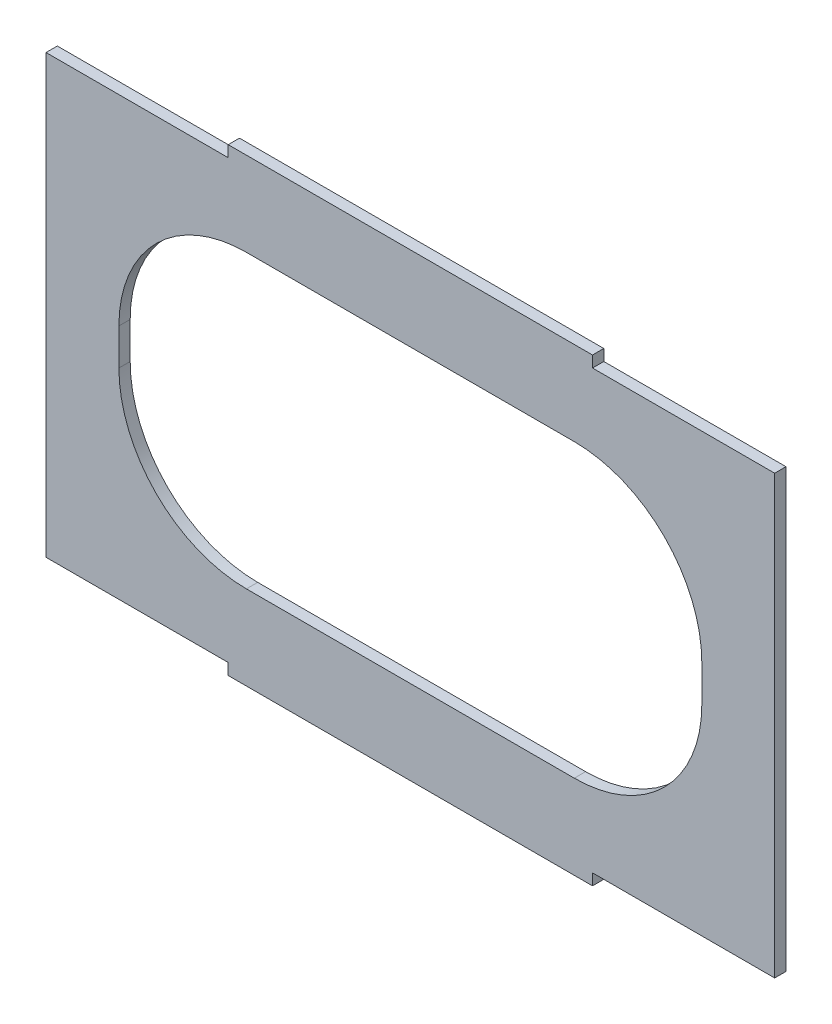
ISO-10303-21;
HEADER;
FILE_DESCRIPTION(('STEP AP214'),'2;1');
FILE_NAME('part.step','',(''),(''),'','','');
FILE_SCHEMA(('AUTOMOTIVE_DESIGN { 1 0 10303 214 1 1 1 1 }'));
ENDSEC;
DATA;
#1=APPLICATION_CONTEXT('core data for automotive mechanical design processes');
#2=APPLICATION_PROTOCOL_DEFINITION('international standard','automotive_design',2000,#1);
#3=PRODUCT_CONTEXT('',#1,'mechanical');
#4=PRODUCT('Part','Part','',(#3));
#5=PRODUCT_RELATED_PRODUCT_CATEGORY('part','',(#4));
#6=PRODUCT_DEFINITION_FORMATION('','',#4);
#7=PRODUCT_DEFINITION_CONTEXT('part definition',#1,'design');
#8=PRODUCT_DEFINITION('design','',#6,#7);
#9=PRODUCT_DEFINITION_SHAPE('','',#8);
#10=(LENGTH_UNIT() NAMED_UNIT(*) SI_UNIT(.MILLI.,.METRE.));
#11=(NAMED_UNIT(*) PLANE_ANGLE_UNIT() SI_UNIT($,.RADIAN.));
#12=(NAMED_UNIT(*) SI_UNIT($,.STERADIAN.) SOLID_ANGLE_UNIT());
#13=UNCERTAINTY_MEASURE_WITH_UNIT(LENGTH_MEASURE(1.E-05),#10,'distance_accuracy_value','');
#14=(GEOMETRIC_REPRESENTATION_CONTEXT(3) GLOBAL_UNCERTAINTY_ASSIGNED_CONTEXT((#13)) GLOBAL_UNIT_ASSIGNED_CONTEXT((#10,
#11,#12)) REPRESENTATION_CONTEXT('',''));
#15=CARTESIAN_POINT('',(0.,0.,0.));
#16=DIRECTION('',(0.,0.,1.));
#17=DIRECTION('',(1.,0.,0.));
#18=AXIS2_PLACEMENT_3D('',#15,#16,#17);
#19=CARTESIAN_POINT('',(-100.,-60.,3.1));
#20=DIRECTION('',(0.,1.,0.));
#21=DIRECTION('',(0.,0.,1.));
#22=AXIS2_PLACEMENT_3D('',#19,#20,#21);
#23=PLANE('',#22);
#24=DIRECTION('',(0.,0.,1.));
#25=VECTOR('',#24,1.);
#26=CARTESIAN_POINT('',(50.,-60.,0.));
#27=LINE('',#26,#25);
#28=CARTESIAN_POINT('',(50.,-60.,0.));
#29=VERTEX_POINT('',#28);
#30=CARTESIAN_POINT('',(50.,-60.,3.1));
#31=VERTEX_POINT('',#30);
#32=EDGE_CURVE('E206',#29,#31,#27,.T.);
#33=ORIENTED_EDGE('',*,*,#32,.F.);
#34=DIRECTION('',(1.,0.,0.));
#35=VECTOR('',#34,1.);
#36=CARTESIAN_POINT('',(-100.,-60.,0.));
#37=LINE('',#36,#35);
#38=CARTESIAN_POINT('',(100.,-60.,0.));
#39=VERTEX_POINT('',#38);
#40=EDGE_CURVE('E256',#29,#39,#37,.T.);
#41=ORIENTED_EDGE('',*,*,#40,.T.);
#42=DIRECTION('',(0.,0.,-1.));
#43=VECTOR('',#42,1.);
#44=CARTESIAN_POINT('',(100.,-60.,3.1));
#45=LINE('',#44,#43);
#46=CARTESIAN_POINT('',(100.,-60.,3.1));
#47=VERTEX_POINT('',#46);
#48=EDGE_CURVE('E263',#47,#39,#45,.T.);
#49=ORIENTED_EDGE('',*,*,#48,.F.);
#50=DIRECTION('',(1.,0.,0.));
#51=VECTOR('',#50,1.);
#52=CARTESIAN_POINT('',(-100.,-60.,3.1));
#53=LINE('',#52,#51);
#54=EDGE_CURVE('E296',#31,#47,#53,.T.);
#55=ORIENTED_EDGE('',*,*,#54,.F.);
#56=EDGE_LOOP('',(#33,#41,#49,#55));
#57=FACE_BOUND('',#56,.T.);
#58=ADVANCED_FACE('F32',(#57),#23,.F.);
#59=CARTESIAN_POINT('',(-100.,60.,3.1));
#60=DIRECTION('',(0.,-1.,0.));
#61=DIRECTION('',(0.,0.,-1.));
#62=AXIS2_PLACEMENT_3D('',#59,#60,#61);
#63=PLANE('',#62);
#64=DIRECTION('',(0.,0.,1.));
#65=VECTOR('',#64,1.);
#66=CARTESIAN_POINT('',(-50.,60.,0.));
#67=LINE('',#66,#65);
#68=CARTESIAN_POINT('',(-50.,60.,0.));
#69=VERTEX_POINT('',#68);
#70=CARTESIAN_POINT('',(-50.,60.,3.1));
#71=VERTEX_POINT('',#70);
#72=EDGE_CURVE('E235',#69,#71,#67,.T.);
#73=ORIENTED_EDGE('',*,*,#72,.F.);
#74=DIRECTION('',(-1.,0.,0.));
#75=VECTOR('',#74,1.);
#76=CARTESIAN_POINT('',(-100.,60.,0.));
#77=LINE('',#76,#75);
#78=CARTESIAN_POINT('',(-100.,60.,0.));
#79=VERTEX_POINT('',#78);
#80=EDGE_CURVE('E281',#69,#79,#77,.T.);
#81=ORIENTED_EDGE('',*,*,#80,.T.);
#82=DIRECTION('',(0.,0.,-1.));
#83=VECTOR('',#82,1.);
#84=CARTESIAN_POINT('',(-100.,60.,3.1));
#85=LINE('',#84,#83);
#86=CARTESIAN_POINT('',(-100.,60.,3.1));
#87=VERTEX_POINT('',#86);
#88=EDGE_CURVE('E271',#87,#79,#85,.T.);
#89=ORIENTED_EDGE('',*,*,#88,.F.);
#90=DIRECTION('',(-1.,0.,0.));
#91=VECTOR('',#90,1.);
#92=CARTESIAN_POINT('',(-100.,60.,3.1));
#93=LINE('',#92,#91);
#94=EDGE_CURVE('E308',#71,#87,#93,.T.);
#95=ORIENTED_EDGE('',*,*,#94,.F.);
#96=EDGE_LOOP('',(#73,#81,#89,#95));
#97=FACE_BOUND('',#96,.T.);
#98=ADVANCED_FACE('F364',(#97),#63,.F.);
#99=CARTESIAN_POINT('',(0.,0.,3.1));
#100=DIRECTION('',(0.,0.,-1.));
#101=DIRECTION('',(-1.,0.,0.));
#102=AXIS2_PLACEMENT_3D('',#99,#100,#101);
#103=PLANE('',#102);
#104=DIRECTION('',(0.,1.,0.));
#105=VECTOR('',#104,1.);
#106=CARTESIAN_POINT('',(100.,-60.,3.1));
#107=LINE('',#106,#105);
#108=CARTESIAN_POINT('',(100.,60.,3.1));
#109=VERTEX_POINT('',#108);
#110=EDGE_CURVE('E255',#47,#109,#107,.T.);
#111=ORIENTED_EDGE('',*,*,#110,.T.);
#112=CARTESIAN_POINT('',(50.,60.,3.1));
#113=VERTEX_POINT('',#112);
#114=EDGE_CURVE('E304',#109,#113,#93,.T.);
#115=ORIENTED_EDGE('',*,*,#114,.T.);
#116=DIRECTION('',(0.,1.,0.));
#117=VECTOR('',#116,1.);
#118=CARTESIAN_POINT('',(50.,63.1,3.1));
#119=LINE('',#118,#117);
#120=CARTESIAN_POINT('',(50.,63.1,3.1));
#121=VERTEX_POINT('',#120);
#122=EDGE_CURVE('E224',#113,#121,#119,.T.);
#123=ORIENTED_EDGE('',*,*,#122,.T.);
#124=DIRECTION('',(-1.,0.,0.));
#125=VECTOR('',#124,1.);
#126=CARTESIAN_POINT('',(-50.,63.1,3.1));
#127=LINE('',#126,#125);
#128=CARTESIAN_POINT('',(-50.,63.1,3.1));
#129=VERTEX_POINT('',#128);
#130=EDGE_CURVE('E220',#121,#129,#127,.T.);
#131=ORIENTED_EDGE('',*,*,#130,.T.);
#132=DIRECTION('',(0.,-1.,0.));
#133=VECTOR('',#132,1.);
#134=CARTESIAN_POINT('',(-50.,63.1,3.1));
#135=LINE('',#134,#133);
#136=EDGE_CURVE('E223',#129,#71,#135,.T.);
#137=ORIENTED_EDGE('',*,*,#136,.T.);
#138=ORIENTED_EDGE('',*,*,#94,.T.);
#139=DIRECTION('',(0.,-1.,0.));
#140=VECTOR('',#139,1.);
#141=CARTESIAN_POINT('',(-100.,-60.,3.1));
#142=LINE('',#141,#140);
#143=CARTESIAN_POINT('',(-100.,-60.,3.1));
#144=VERTEX_POINT('',#143);
#145=EDGE_CURVE('E292',#87,#144,#142,.T.);
#146=ORIENTED_EDGE('',*,*,#145,.T.);
#147=CARTESIAN_POINT('',(-50.,-60.,3.1));
#148=VERTEX_POINT('',#147);
#149=EDGE_CURVE('E268',#144,#148,#53,.T.);
#150=ORIENTED_EDGE('',*,*,#149,.T.);
#151=DIRECTION('',(0.,-1.,0.));
#152=VECTOR('',#151,1.);
#153=CARTESIAN_POINT('',(-50.,-63.1,3.1));
#154=LINE('',#153,#152);
#155=CARTESIAN_POINT('',(-50.,-63.1,3.1));
#156=VERTEX_POINT('',#155);
#157=EDGE_CURVE('E416',#148,#156,#154,.T.);
#158=ORIENTED_EDGE('',*,*,#157,.T.);
#159=DIRECTION('',(1.,0.,0.));
#160=VECTOR('',#159,1.);
#161=CARTESIAN_POINT('',(-50.,-63.1,3.1));
#162=LINE('',#161,#160);
#163=CARTESIAN_POINT('',(50.,-63.1,3.1));
#164=VERTEX_POINT('',#163);
#165=EDGE_CURVE('E175',#156,#164,#162,.T.);
#166=ORIENTED_EDGE('',*,*,#165,.T.);
#167=DIRECTION('',(0.,1.,0.));
#168=VECTOR('',#167,1.);
#169=CARTESIAN_POINT('',(50.,-63.1,3.1));
#170=LINE('',#169,#168);
#171=EDGE_CURVE('E196',#164,#31,#170,.T.);
#172=ORIENTED_EDGE('',*,*,#171,.T.);
#173=ORIENTED_EDGE('',*,*,#54,.T.);
#174=EDGE_LOOP('',(#111,#115,#123,#131,#137,#138,#146,#150,#158,#166,#172,#173));
#175=FACE_BOUND('',#174,.T.);
#176=DIRECTION('',(0.,1.,0.));
#177=VECTOR('',#176,1.);
#178=CARTESIAN_POINT('',(80.,-40.,3.1));
#179=LINE('',#178,#177);
#180=CARTESIAN_POINT('',(80.,-5.00000000000001,3.1));
#181=VERTEX_POINT('',#180);
#182=CARTESIAN_POINT('',(80.,5.00000000000002,3.1));
#183=VERTEX_POINT('',#182);
#184=EDGE_CURVE('E318',#181,#183,#179,.T.);
#185=ORIENTED_EDGE('',*,*,#184,.F.);
#186=CARTESIAN_POINT('',(45.,-5.,3.1));
#187=DIRECTION('',(0.,0.,-1.));
#188=DIRECTION('',(-1.,0.,0.));
#189=AXIS2_PLACEMENT_3D('',#186,#187,#188);
#190=CIRCLE('',#189,35.);
#191=CARTESIAN_POINT('',(45.,-40.,3.1));
#192=VERTEX_POINT('',#191);
#193=EDGE_CURVE('E591',#181,#192,#190,.T.);
#194=ORIENTED_EDGE('',*,*,#193,.T.);
#195=DIRECTION('',(1.,0.,0.));
#196=VECTOR('',#195,1.);
#197=CARTESIAN_POINT('',(-80.,-40.,3.1));
#198=LINE('',#197,#196);
#199=CARTESIAN_POINT('',(-45.,-40.,3.1));
#200=VERTEX_POINT('',#199);
#201=EDGE_CURVE('E289',#200,#192,#198,.T.);
#202=ORIENTED_EDGE('',*,*,#201,.F.);
#203=CARTESIAN_POINT('',(-45.,-5.,3.1));
#204=DIRECTION('',(0.,0.,-1.));
#205=DIRECTION('',(-1.,0.,0.));
#206=AXIS2_PLACEMENT_3D('',#203,#204,#205);
#207=CIRCLE('',#206,35.);
#208=CARTESIAN_POINT('',(-80.,-5.00000000000001,3.1));
#209=VERTEX_POINT('',#208);
#210=EDGE_CURVE('E47',#200,#209,#207,.T.);
#211=ORIENTED_EDGE('',*,*,#210,.T.);
#212=DIRECTION('',(0.,-1.,0.));
#213=VECTOR('',#212,1.);
#214=CARTESIAN_POINT('',(-80.,-40.,3.1));
#215=LINE('',#214,#213);
#216=CARTESIAN_POINT('',(-80.,5.00000000000002,3.1));
#217=VERTEX_POINT('',#216);
#218=EDGE_CURVE('E329',#217,#209,#215,.T.);
#219=ORIENTED_EDGE('',*,*,#218,.F.);
#220=CARTESIAN_POINT('',(-45.,5.00000000000004,3.1));
#221=DIRECTION('',(0.,0.,-1.));
#222=DIRECTION('',(-1.,0.,0.));
#223=AXIS2_PLACEMENT_3D('',#220,#221,#222);
#224=CIRCLE('',#223,35.);
#225=CARTESIAN_POINT('',(-45.,40.,3.1));
#226=VERTEX_POINT('',#225);
#227=EDGE_CURVE('E11',#217,#226,#224,.T.);
#228=ORIENTED_EDGE('',*,*,#227,.T.);
#229=DIRECTION('',(-1.,0.,0.));
#230=VECTOR('',#229,1.);
#231=CARTESIAN_POINT('',(-80.,40.,3.1));
#232=LINE('',#231,#230);
#233=CARTESIAN_POINT('',(45.,40.,3.1));
#234=VERTEX_POINT('',#233);
#235=EDGE_CURVE('E331',#234,#226,#232,.T.);
#236=ORIENTED_EDGE('',*,*,#235,.F.);
#237=CARTESIAN_POINT('',(45.,5.00000000000004,3.1));
#238=DIRECTION('',(0.,0.,-1.));
#239=DIRECTION('',(-1.,0.,0.));
#240=AXIS2_PLACEMENT_3D('',#237,#238,#239);
#241=CIRCLE('',#240,35.);
#242=EDGE_CURVE('E595',#234,#183,#241,.T.);
#243=ORIENTED_EDGE('',*,*,#242,.T.);
#244=EDGE_LOOP('',(#185,#194,#202,#211,#219,#228,#236,#243));
#245=FACE_BOUND('',#244,.T.);
#246=ADVANCED_FACE('F346',(#175,#245),#103,.F.);
#247=CARTESIAN_POINT('',(0.,0.,0.));
#248=DIRECTION('',(0.,0.,-1.));
#249=DIRECTION('',(-1.,0.,0.));
#250=AXIS2_PLACEMENT_3D('',#247,#248,#249);
#251=PLANE('',#250);
#252=DIRECTION('',(0.,1.,0.));
#253=VECTOR('',#252,1.);
#254=CARTESIAN_POINT('',(100.,-60.,0.));
#255=LINE('',#254,#253);
#256=CARTESIAN_POINT('',(100.,60.,0.));
#257=VERTEX_POINT('',#256);
#258=EDGE_CURVE('E285',#39,#257,#255,.T.);
#259=ORIENTED_EDGE('',*,*,#258,.F.);
#260=ORIENTED_EDGE('',*,*,#40,.F.);
#261=DIRECTION('',(0.,1.,0.));
#262=VECTOR('',#261,1.);
#263=CARTESIAN_POINT('',(50.,-63.1,0.));
#264=LINE('',#263,#262);
#265=CARTESIAN_POINT('',(50.,-63.1,0.));
#266=VERTEX_POINT('',#265);
#267=EDGE_CURVE('E180',#266,#29,#264,.T.);
#268=ORIENTED_EDGE('',*,*,#267,.F.);
#269=DIRECTION('',(1.,0.,0.));
#270=VECTOR('',#269,1.);
#271=CARTESIAN_POINT('',(-50.,-63.1,0.));
#272=LINE('',#271,#270);
#273=CARTESIAN_POINT('',(-50.,-63.1,0.));
#274=VERTEX_POINT('',#273);
#275=EDGE_CURVE('E173',#274,#266,#272,.T.);
#276=ORIENTED_EDGE('',*,*,#275,.F.);
#277=DIRECTION('',(0.,-1.,0.));
#278=VECTOR('',#277,1.);
#279=CARTESIAN_POINT('',(-50.,-63.1,0.));
#280=LINE('',#279,#278);
#281=CARTESIAN_POINT('',(-50.,-60.,0.));
#282=VERTEX_POINT('',#281);
#283=EDGE_CURVE('E189',#282,#274,#280,.T.);
#284=ORIENTED_EDGE('',*,*,#283,.F.);
#285=CARTESIAN_POINT('',(-100.,-60.,0.));
#286=VERTEX_POINT('',#285);
#287=EDGE_CURVE('E252',#286,#282,#37,.T.);
#288=ORIENTED_EDGE('',*,*,#287,.F.);
#289=DIRECTION('',(0.,-1.,0.));
#290=VECTOR('',#289,1.);
#291=CARTESIAN_POINT('',(-100.,-60.,0.));
#292=LINE('',#291,#290);
#293=EDGE_CURVE('E261',#79,#286,#292,.T.);
#294=ORIENTED_EDGE('',*,*,#293,.F.);
#295=ORIENTED_EDGE('',*,*,#80,.F.);
#296=DIRECTION('',(0.,-1.,0.));
#297=VECTOR('',#296,1.);
#298=CARTESIAN_POINT('',(-50.,63.1,0.));
#299=LINE('',#298,#297);
#300=CARTESIAN_POINT('',(-50.,63.1,0.));
#301=VERTEX_POINT('',#300);
#302=EDGE_CURVE('E218',#301,#69,#299,.T.);
#303=ORIENTED_EDGE('',*,*,#302,.F.);
#304=DIRECTION('',(-1.,0.,0.));
#305=VECTOR('',#304,1.);
#306=CARTESIAN_POINT('',(-50.,63.1,0.));
#307=LINE('',#306,#305);
#308=CARTESIAN_POINT('',(50.,63.1,0.));
#309=VERTEX_POINT('',#308);
#310=EDGE_CURVE('E215',#309,#301,#307,.T.);
#311=ORIENTED_EDGE('',*,*,#310,.F.);
#312=DIRECTION('',(0.,1.,0.));
#313=VECTOR('',#312,1.);
#314=CARTESIAN_POINT('',(50.,63.1,0.));
#315=LINE('',#314,#313);
#316=CARTESIAN_POINT('',(50.,60.,0.));
#317=VERTEX_POINT('',#316);
#318=EDGE_CURVE('E219',#317,#309,#315,.T.);
#319=ORIENTED_EDGE('',*,*,#318,.F.);
#320=EDGE_CURVE('E278',#257,#317,#77,.T.);
#321=ORIENTED_EDGE('',*,*,#320,.F.);
#322=EDGE_LOOP('',(#259,#260,#268,#276,#284,#288,#294,#295,#303,#311,#319,#321));
#323=FACE_BOUND('',#322,.T.);
#324=DIRECTION('',(0.,-1.,0.));
#325=VECTOR('',#324,1.);
#326=CARTESIAN_POINT('',(-80.,-40.,0.));
#327=LINE('',#326,#325);
#328=CARTESIAN_POINT('',(-80.,5.00000000000002,0.));
#329=VERTEX_POINT('',#328);
#330=CARTESIAN_POINT('',(-80.,-5.00000000000001,0.));
#331=VERTEX_POINT('',#330);
#332=EDGE_CURVE('E319',#329,#331,#327,.T.);
#333=ORIENTED_EDGE('',*,*,#332,.T.);
#334=CARTESIAN_POINT('',(-45.,-5.,0.));
#335=DIRECTION('',(0.,0.,-1.));
#336=DIRECTION('',(-1.,0.,0.));
#337=AXIS2_PLACEMENT_3D('',#334,#335,#336);
#338=CIRCLE('',#337,35.);
#339=CARTESIAN_POINT('',(-45.,-40.,0.));
#340=VERTEX_POINT('',#339);
#341=EDGE_CURVE('E597',#331,#340,#338,.F.);
#342=ORIENTED_EDGE('',*,*,#341,.T.);
#343=DIRECTION('',(1.,0.,0.));
#344=VECTOR('',#343,1.);
#345=CARTESIAN_POINT('',(-80.,-40.,0.));
#346=LINE('',#345,#344);
#347=CARTESIAN_POINT('',(45.,-40.,0.));
#348=VERTEX_POINT('',#347);
#349=EDGE_CURVE('E315',#340,#348,#346,.T.);
#350=ORIENTED_EDGE('',*,*,#349,.T.);
#351=CARTESIAN_POINT('',(45.,-5.,0.));
#352=DIRECTION('',(0.,0.,-1.));
#353=DIRECTION('',(-1.,0.,0.));
#354=AXIS2_PLACEMENT_3D('',#351,#352,#353);
#355=CIRCLE('',#354,35.);
#356=CARTESIAN_POINT('',(80.,-5.00000000000001,0.));
#357=VERTEX_POINT('',#356);
#358=EDGE_CURVE('E589',#348,#357,#355,.F.);
#359=ORIENTED_EDGE('',*,*,#358,.T.);
#360=DIRECTION('',(0.,1.,0.));
#361=VECTOR('',#360,1.);
#362=CARTESIAN_POINT('',(80.,-40.,0.));
#363=LINE('',#362,#361);
#364=CARTESIAN_POINT('',(80.,5.00000000000002,0.));
#365=VERTEX_POINT('',#364);
#366=EDGE_CURVE('E234',#357,#365,#363,.T.);
#367=ORIENTED_EDGE('',*,*,#366,.T.);
#368=CARTESIAN_POINT('',(45.,5.00000000000004,0.));
#369=DIRECTION('',(0.,0.,-1.));
#370=DIRECTION('',(-1.,0.,0.));
#371=AXIS2_PLACEMENT_3D('',#368,#369,#370);
#372=CIRCLE('',#371,35.);
#373=CARTESIAN_POINT('',(45.,40.,0.));
#374=VERTEX_POINT('',#373);
#375=EDGE_CURVE('E593',#365,#374,#372,.F.);
#376=ORIENTED_EDGE('',*,*,#375,.T.);
#377=DIRECTION('',(-1.,0.,0.));
#378=VECTOR('',#377,1.);
#379=CARTESIAN_POINT('',(-80.,40.,0.));
#380=LINE('',#379,#378);
#381=CARTESIAN_POINT('',(-45.,40.,0.));
#382=VERTEX_POINT('',#381);
#383=EDGE_CURVE('E322',#374,#382,#380,.T.);
#384=ORIENTED_EDGE('',*,*,#383,.T.);
#385=CARTESIAN_POINT('',(-45.,5.00000000000004,0.));
#386=DIRECTION('',(0.,0.,-1.));
#387=DIRECTION('',(-1.,0.,0.));
#388=AXIS2_PLACEMENT_3D('',#385,#386,#387);
#389=CIRCLE('',#388,35.);
#390=EDGE_CURVE('E40',#382,#329,#389,.F.);
#391=ORIENTED_EDGE('',*,*,#390,.T.);
#392=EDGE_LOOP('',(#333,#342,#350,#359,#367,#376,#384,#391));
#393=FACE_BOUND('',#392,.T.);
#394=ADVANCED_FACE('F186',(#323,#393),#251,.T.);
#395=CARTESIAN_POINT('',(100.,-60.,3.1));
#396=DIRECTION('',(-1.,0.,0.));
#397=DIRECTION('',(0.,0.,1.));
#398=AXIS2_PLACEMENT_3D('',#395,#396,#397);
#399=PLANE('',#398);
#400=ORIENTED_EDGE('',*,*,#258,.T.);
#401=DIRECTION('',(0.,0.,-1.));
#402=VECTOR('',#401,1.);
#403=CARTESIAN_POINT('',(100.,60.,3.1));
#404=LINE('',#403,#402);
#405=EDGE_CURVE('E274',#109,#257,#404,.T.);
#406=ORIENTED_EDGE('',*,*,#405,.F.);
#407=ORIENTED_EDGE('',*,*,#110,.F.);
#408=ORIENTED_EDGE('',*,*,#48,.T.);
#409=EDGE_LOOP('',(#400,#406,#407,#408));
#410=FACE_BOUND('',#409,.T.);
#411=ADVANCED_FACE('F357',(#410),#399,.F.);
#412=ORIENTED_EDGE('',*,*,#320,.T.);
#413=DIRECTION('',(0.,0.,1.));
#414=VECTOR('',#413,1.);
#415=CARTESIAN_POINT('',(50.,60.,0.));
#416=LINE('',#415,#414);
#417=EDGE_CURVE('E230',#317,#113,#416,.T.);
#418=ORIENTED_EDGE('',*,*,#417,.T.);
#419=ORIENTED_EDGE('',*,*,#114,.F.);
#420=ORIENTED_EDGE('',*,*,#405,.T.);
#421=EDGE_LOOP('',(#412,#418,#419,#420));
#422=FACE_BOUND('',#421,.T.);
#423=ADVANCED_FACE('F361',(#422),#63,.F.);
#424=CARTESIAN_POINT('',(-100.,-60.,3.1));
#425=DIRECTION('',(1.,0.,0.));
#426=DIRECTION('',(0.,0.,-1.));
#427=AXIS2_PLACEMENT_3D('',#424,#425,#426);
#428=PLANE('',#427);
#429=ORIENTED_EDGE('',*,*,#293,.T.);
#430=DIRECTION('',(0.,0.,-1.));
#431=VECTOR('',#430,1.);
#432=CARTESIAN_POINT('',(-100.,-60.,3.1));
#433=LINE('',#432,#431);
#434=EDGE_CURVE('E267',#144,#286,#433,.T.);
#435=ORIENTED_EDGE('',*,*,#434,.F.);
#436=ORIENTED_EDGE('',*,*,#145,.F.);
#437=ORIENTED_EDGE('',*,*,#88,.T.);
#438=EDGE_LOOP('',(#429,#435,#436,#437));
#439=FACE_BOUND('',#438,.T.);
#440=ADVANCED_FACE('F366',(#439),#428,.F.);
#441=ORIENTED_EDGE('',*,*,#287,.T.);
#442=DIRECTION('',(0.,0.,1.));
#443=VECTOR('',#442,1.);
#444=CARTESIAN_POINT('',(-50.,-60.,0.));
#445=LINE('',#444,#443);
#446=EDGE_CURVE('E195',#282,#148,#445,.T.);
#447=ORIENTED_EDGE('',*,*,#446,.T.);
#448=ORIENTED_EDGE('',*,*,#149,.F.);
#449=ORIENTED_EDGE('',*,*,#434,.T.);
#450=EDGE_LOOP('',(#441,#447,#448,#449));
#451=FACE_BOUND('',#450,.T.);
#452=ADVANCED_FACE('F349',(#451),#23,.F.);
#453=CARTESIAN_POINT('',(80.,-40.,3.1));
#454=DIRECTION('',(-1.,0.,0.));
#455=DIRECTION('',(0.,0.,1.));
#456=AXIS2_PLACEMENT_3D('',#453,#454,#455);
#457=PLANE('',#456);
#458=ORIENTED_EDGE('',*,*,#366,.F.);
#459=DIRECTION('',(0.,0.,-1.));
#460=VECTOR('',#459,1.);
#461=CARTESIAN_POINT('',(80.,-5.,3.1));
#462=LINE('',#461,#460);
#463=EDGE_CURVE('E583',#357,#181,#462,.F.);
#464=ORIENTED_EDGE('',*,*,#463,.T.);
#465=ORIENTED_EDGE('',*,*,#184,.T.);
#466=DIRECTION('',(0.,0.,-1.));
#467=VECTOR('',#466,1.);
#468=CARTESIAN_POINT('',(80.,5.00000000000004,0.));
#469=LINE('',#468,#467);
#470=EDGE_CURVE('E606',#183,#365,#469,.T.);
#471=ORIENTED_EDGE('',*,*,#470,.T.);
#472=EDGE_LOOP('',(#458,#464,#465,#471));
#473=FACE_BOUND('',#472,.T.);
#474=ADVANCED_FACE('F373',(#473),#457,.T.);
#475=CARTESIAN_POINT('',(-80.,40.,3.1));
#476=DIRECTION('',(0.,-1.,0.));
#477=DIRECTION('',(0.,0.,-1.));
#478=AXIS2_PLACEMENT_3D('',#475,#476,#477);
#479=PLANE('',#478);
#480=ORIENTED_EDGE('',*,*,#383,.F.);
#481=DIRECTION('',(0.,0.,-1.));
#482=VECTOR('',#481,1.);
#483=CARTESIAN_POINT('',(45.,40.,3.1));
#484=LINE('',#483,#482);
#485=EDGE_CURVE('E579',#374,#234,#484,.F.);
#486=ORIENTED_EDGE('',*,*,#485,.T.);
#487=ORIENTED_EDGE('',*,*,#235,.T.);
#488=DIRECTION('',(0.,0.,-1.));
#489=VECTOR('',#488,1.);
#490=CARTESIAN_POINT('',(-45.,40.,0.));
#491=LINE('',#490,#489);
#492=EDGE_CURVE('E573',#226,#382,#491,.T.);
#493=ORIENTED_EDGE('',*,*,#492,.T.);
#494=EDGE_LOOP('',(#480,#486,#487,#493));
#495=FACE_BOUND('',#494,.T.);
#496=ADVANCED_FACE('F387',(#495),#479,.T.);
#497=CARTESIAN_POINT('',(-80.,-40.,3.1));
#498=DIRECTION('',(1.,0.,0.));
#499=DIRECTION('',(0.,0.,-1.));
#500=AXIS2_PLACEMENT_3D('',#497,#498,#499);
#501=PLANE('',#500);
#502=ORIENTED_EDGE('',*,*,#218,.T.);
#503=DIRECTION('',(0.,0.,-1.));
#504=VECTOR('',#503,1.);
#505=CARTESIAN_POINT('',(-80.,-5.,0.));
#506=LINE('',#505,#504);
#507=EDGE_CURVE('E581',#209,#331,#506,.T.);
#508=ORIENTED_EDGE('',*,*,#507,.T.);
#509=ORIENTED_EDGE('',*,*,#332,.F.);
#510=DIRECTION('',(0.,0.,-1.));
#511=VECTOR('',#510,1.);
#512=CARTESIAN_POINT('',(-80.,5.00000000000004,3.1));
#513=LINE('',#512,#511);
#514=EDGE_CURVE('E54',#329,#217,#513,.F.);
#515=ORIENTED_EDGE('',*,*,#514,.T.);
#516=EDGE_LOOP('',(#502,#508,#509,#515));
#517=FACE_BOUND('',#516,.T.);
#518=ADVANCED_FACE('F391',(#517),#501,.T.);
#519=CARTESIAN_POINT('',(-80.,-40.,3.1));
#520=DIRECTION('',(0.,1.,0.));
#521=DIRECTION('',(0.,0.,1.));
#522=AXIS2_PLACEMENT_3D('',#519,#520,#521);
#523=PLANE('',#522);
#524=ORIENTED_EDGE('',*,*,#201,.T.);
#525=DIRECTION('',(0.,0.,-1.));
#526=VECTOR('',#525,1.);
#527=CARTESIAN_POINT('',(45.,-40.,0.));
#528=LINE('',#527,#526);
#529=EDGE_CURVE('E604',#192,#348,#528,.T.);
#530=ORIENTED_EDGE('',*,*,#529,.T.);
#531=ORIENTED_EDGE('',*,*,#349,.F.);
#532=DIRECTION('',(0.,0.,-1.));
#533=VECTOR('',#532,1.);
#534=CARTESIAN_POINT('',(-45.,-40.,3.1));
#535=LINE('',#534,#533);
#536=EDGE_CURVE('E277',#340,#200,#535,.F.);
#537=ORIENTED_EDGE('',*,*,#536,.T.);
#538=EDGE_LOOP('',(#524,#530,#531,#537));
#539=FACE_BOUND('',#538,.T.);
#540=ADVANCED_FACE('F395',(#539),#523,.T.);
#541=CARTESIAN_POINT('',(50.,63.1,0.));
#542=DIRECTION('',(1.,0.,0.));
#543=DIRECTION('',(0.,0.,-1.));
#544=AXIS2_PLACEMENT_3D('',#541,#542,#543);
#545=PLANE('',#544);
#546=ORIENTED_EDGE('',*,*,#122,.F.);
#547=ORIENTED_EDGE('',*,*,#417,.F.);
#548=ORIENTED_EDGE('',*,*,#318,.T.);
#549=DIRECTION('',(0.,0.,1.));
#550=VECTOR('',#549,1.);
#551=CARTESIAN_POINT('',(50.,63.1,0.));
#552=LINE('',#551,#550);
#553=EDGE_CURVE('E245',#309,#121,#552,.T.);
#554=ORIENTED_EDGE('',*,*,#553,.T.);
#555=EDGE_LOOP('',(#546,#547,#548,#554));
#556=FACE_BOUND('',#555,.T.);
#557=ADVANCED_FACE('F362',(#556),#545,.T.);
#558=CARTESIAN_POINT('',(-50.,63.1,0.));
#559=DIRECTION('',(-1.,0.,0.));
#560=DIRECTION('',(0.,0.,1.));
#561=AXIS2_PLACEMENT_3D('',#558,#559,#560);
#562=PLANE('',#561);
#563=ORIENTED_EDGE('',*,*,#136,.F.);
#564=DIRECTION('',(0.,0.,1.));
#565=VECTOR('',#564,1.);
#566=CARTESIAN_POINT('',(-50.,63.1,0.));
#567=LINE('',#566,#565);
#568=EDGE_CURVE('E243',#301,#129,#567,.T.);
#569=ORIENTED_EDGE('',*,*,#568,.F.);
#570=ORIENTED_EDGE('',*,*,#302,.T.);
#571=ORIENTED_EDGE('',*,*,#72,.T.);
#572=EDGE_LOOP('',(#563,#569,#570,#571));
#573=FACE_BOUND('',#572,.T.);
#574=ADVANCED_FACE('F343',(#573),#562,.T.);
#575=CARTESIAN_POINT('',(-50.,63.1,0.));
#576=DIRECTION('',(0.,1.,0.));
#577=DIRECTION('',(0.,0.,1.));
#578=AXIS2_PLACEMENT_3D('',#575,#576,#577);
#579=PLANE('',#578);
#580=ORIENTED_EDGE('',*,*,#130,.F.);
#581=ORIENTED_EDGE('',*,*,#553,.F.);
#582=ORIENTED_EDGE('',*,*,#310,.T.);
#583=ORIENTED_EDGE('',*,*,#568,.T.);
#584=EDGE_LOOP('',(#580,#581,#582,#583));
#585=FACE_BOUND('',#584,.T.);
#586=ADVANCED_FACE('F339',(#585),#579,.T.);
#587=CARTESIAN_POINT('',(-50.,-63.1,0.));
#588=DIRECTION('',(-1.,0.,0.));
#589=DIRECTION('',(0.,0.,1.));
#590=AXIS2_PLACEMENT_3D('',#587,#588,#589);
#591=PLANE('',#590);
#592=ORIENTED_EDGE('',*,*,#157,.F.);
#593=ORIENTED_EDGE('',*,*,#446,.F.);
#594=ORIENTED_EDGE('',*,*,#283,.T.);
#595=DIRECTION('',(0.,0.,1.));
#596=VECTOR('',#595,1.);
#597=CARTESIAN_POINT('',(-50.,-63.1,0.));
#598=LINE('',#597,#596);
#599=EDGE_CURVE('E170',#274,#156,#598,.T.);
#600=ORIENTED_EDGE('',*,*,#599,.T.);
#601=EDGE_LOOP('',(#592,#593,#594,#600));
#602=FACE_BOUND('',#601,.T.);
#603=ADVANCED_FACE('F193',(#602),#591,.T.);
#604=CARTESIAN_POINT('',(50.,-63.1,0.));
#605=DIRECTION('',(1.,0.,0.));
#606=DIRECTION('',(0.,0.,-1.));
#607=AXIS2_PLACEMENT_3D('',#604,#605,#606);
#608=PLANE('',#607);
#609=ORIENTED_EDGE('',*,*,#171,.F.);
#610=DIRECTION('',(0.,0.,1.));
#611=VECTOR('',#610,1.);
#612=CARTESIAN_POINT('',(50.,-63.1,0.));
#613=LINE('',#612,#611);
#614=EDGE_CURVE('E179',#266,#164,#613,.T.);
#615=ORIENTED_EDGE('',*,*,#614,.F.);
#616=ORIENTED_EDGE('',*,*,#267,.T.);
#617=ORIENTED_EDGE('',*,*,#32,.T.);
#618=EDGE_LOOP('',(#609,#615,#616,#617));
#619=FACE_BOUND('',#618,.T.);
#620=ADVANCED_FACE('F407',(#619),#608,.T.);
#621=CARTESIAN_POINT('',(-50.,-63.1,0.));
#622=DIRECTION('',(0.,-1.,0.));
#623=DIRECTION('',(0.,0.,-1.));
#624=AXIS2_PLACEMENT_3D('',#621,#622,#623);
#625=PLANE('',#624);
#626=ORIENTED_EDGE('',*,*,#165,.F.);
#627=ORIENTED_EDGE('',*,*,#599,.F.);
#628=ORIENTED_EDGE('',*,*,#275,.T.);
#629=ORIENTED_EDGE('',*,*,#614,.T.);
#630=EDGE_LOOP('',(#626,#627,#628,#629));
#631=FACE_BOUND('',#630,.T.);
#632=ADVANCED_FACE('F172',(#631),#625,.T.);
#633=CARTESIAN_POINT('',(45.,-5.,3.1));
#634=DIRECTION('',(0.,0.,1.));
#635=DIRECTION('',(1.,0.,0.));
#636=AXIS2_PLACEMENT_3D('',#633,#634,#635);
#637=CYLINDRICAL_SURFACE('',#636,35.);
#638=ORIENTED_EDGE('',*,*,#193,.F.);
#639=ORIENTED_EDGE('',*,*,#463,.F.);
#640=ORIENTED_EDGE('',*,*,#358,.F.);
#641=ORIENTED_EDGE('',*,*,#529,.F.);
#642=EDGE_LOOP('',(#638,#639,#640,#641));
#643=FACE_BOUND('',#642,.T.);
#644=ADVANCED_FACE('F410',(#643),#637,.F.);
#645=CARTESIAN_POINT('',(45.,5.00000000000004,3.1));
#646=DIRECTION('',(0.,0.,1.));
#647=DIRECTION('',(1.,0.,0.));
#648=AXIS2_PLACEMENT_3D('',#645,#646,#647);
#649=CYLINDRICAL_SURFACE('',#648,35.);
#650=ORIENTED_EDGE('',*,*,#242,.F.);
#651=ORIENTED_EDGE('',*,*,#485,.F.);
#652=ORIENTED_EDGE('',*,*,#375,.F.);
#653=ORIENTED_EDGE('',*,*,#470,.F.);
#654=EDGE_LOOP('',(#650,#651,#652,#653));
#655=FACE_BOUND('',#654,.T.);
#656=ADVANCED_FACE('F431',(#655),#649,.F.);
#657=CARTESIAN_POINT('',(-45.,-5.,3.1));
#658=DIRECTION('',(0.,0.,1.));
#659=DIRECTION('',(1.,0.,0.));
#660=AXIS2_PLACEMENT_3D('',#657,#658,#659);
#661=CYLINDRICAL_SURFACE('',#660,35.);
#662=ORIENTED_EDGE('',*,*,#210,.F.);
#663=ORIENTED_EDGE('',*,*,#536,.F.);
#664=ORIENTED_EDGE('',*,*,#341,.F.);
#665=ORIENTED_EDGE('',*,*,#507,.F.);
#666=EDGE_LOOP('',(#662,#663,#664,#665));
#667=FACE_BOUND('',#666,.T.);
#668=ADVANCED_FACE('F440',(#667),#661,.F.);
#669=CARTESIAN_POINT('',(-45.,5.00000000000004,3.1));
#670=DIRECTION('',(0.,0.,1.));
#671=DIRECTION('',(1.,0.,0.));
#672=AXIS2_PLACEMENT_3D('',#669,#670,#671);
#673=CYLINDRICAL_SURFACE('',#672,35.);
#674=ORIENTED_EDGE('',*,*,#227,.F.);
#675=ORIENTED_EDGE('',*,*,#514,.F.);
#676=ORIENTED_EDGE('',*,*,#390,.F.);
#677=ORIENTED_EDGE('',*,*,#492,.F.);
#678=EDGE_LOOP('',(#674,#675,#676,#677));
#679=FACE_BOUND('',#678,.T.);
#680=ADVANCED_FACE('F34',(#679),#673,.F.);
#681=CLOSED_SHELL('',(#58,#98,#246,#394,#411,#423,#440,#452,#474,#496,#518,#540,#557,#574,#586,
#603,#620,#632,#644,#656,#668,#680));
#682=MANIFOLD_SOLID_BREP('B2',#681);
#683=ADVANCED_BREP_SHAPE_REPRESENTATION('',(#18,#682),#14);
#684=SHAPE_DEFINITION_REPRESENTATION(#9,#683);
ENDSEC;
END-ISO-10303-21;
